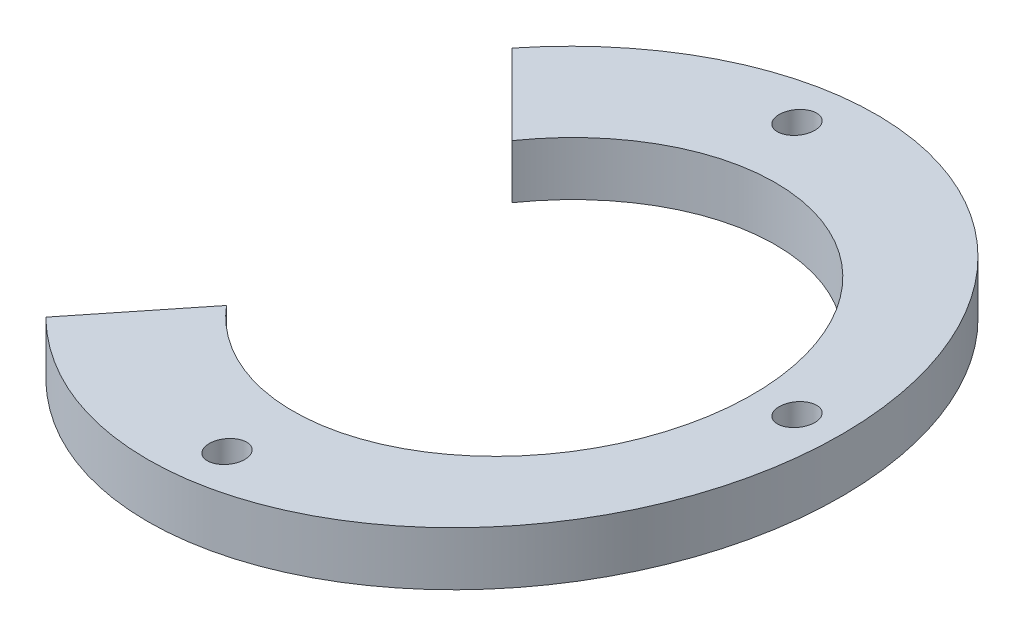
ISO-10303-21;
HEADER;
FILE_DESCRIPTION(('STEP AP214'),'2;1');
FILE_NAME('part.step','',(''),(''),'','','');
FILE_SCHEMA(('AUTOMOTIVE_DESIGN { 1 0 10303 214 1 1 1 1 }'));
ENDSEC;
DATA;
#1=APPLICATION_CONTEXT('core data for automotive mechanical design processes');
#2=APPLICATION_PROTOCOL_DEFINITION('international standard','automotive_design',2000,#1);
#3=PRODUCT_CONTEXT('',#1,'mechanical');
#4=PRODUCT('Part','Part','',(#3));
#5=PRODUCT_RELATED_PRODUCT_CATEGORY('part','',(#4));
#6=PRODUCT_DEFINITION_FORMATION('','',#4);
#7=PRODUCT_DEFINITION_CONTEXT('part definition',#1,'design');
#8=PRODUCT_DEFINITION('design','',#6,#7);
#9=PRODUCT_DEFINITION_SHAPE('','',#8);
#10=(LENGTH_UNIT() NAMED_UNIT(*) SI_UNIT(.MILLI.,.METRE.));
#11=(NAMED_UNIT(*) PLANE_ANGLE_UNIT() SI_UNIT($,.RADIAN.));
#12=(NAMED_UNIT(*) SI_UNIT($,.STERADIAN.) SOLID_ANGLE_UNIT());
#13=UNCERTAINTY_MEASURE_WITH_UNIT(LENGTH_MEASURE(1.E-05),#10,'distance_accuracy_value','');
#14=(GEOMETRIC_REPRESENTATION_CONTEXT(3) GLOBAL_UNCERTAINTY_ASSIGNED_CONTEXT((#13)) GLOBAL_UNIT_ASSIGNED_CONTEXT((#10,
#11,#12)) REPRESENTATION_CONTEXT('',''));
#15=CARTESIAN_POINT('',(0.,0.,0.));
#16=DIRECTION('',(0.,0.,1.));
#17=DIRECTION('',(1.,0.,0.));
#18=AXIS2_PLACEMENT_3D('',#15,#16,#17);
#19=CARTESIAN_POINT('',(1.04083408558608E-13,50.,-32.));
#20=DIRECTION('',(0.,-1.,0.));
#21=DIRECTION('',(0.,0.,-1.));
#22=AXIS2_PLACEMENT_3D('',#19,#20,#21);
#23=CYLINDRICAL_SURFACE('',#22,2.);
#24=CARTESIAN_POINT('',(1.04083408558608E-13,6.16275729327941,-32.));
#25=DIRECTION('',(-0.111468932206326,0.993767919160596,0.));
#26=DIRECTION('',(-0.993767919160596,-0.111468932206326,0.));
#27=AXIS2_PLACEMENT_3D('',#24,#25,#26);
#28=ELLIPSE('',#27,2.01254232647129,2.);
#29=CARTESIAN_POINT('',(-1.9999999999999,5.93842134912762,-32.));
#30=VERTEX_POINT('',#29);
#31=EDGE_CURVE('E121',#30,#30,#28,.F.);
#32=ORIENTED_EDGE('',*,*,#31,.T.);
#33=EDGE_LOOP('',(#32));
#34=FACE_BOUND('',#33,.T.);
#35=CARTESIAN_POINT('',(1.04083408558608E-13,10.187841946222,-32.));
#36=DIRECTION('',(0.111468932206326,-0.993767919160596,0.));
#37=DIRECTION('',(-0.993767919160596,-0.111468932206326,0.));
#38=AXIS2_PLACEMENT_3D('',#35,#36,#37);
#39=ELLIPSE('',#38,2.01254232647129,2.);
#40=CARTESIAN_POINT('',(-1.9999999999999,9.9635060020702,-32.));
#41=VERTEX_POINT('',#40);
#42=EDGE_CURVE('E116',#41,#41,#39,.F.);
#43=ORIENTED_EDGE('',*,*,#42,.T.);
#44=EDGE_LOOP('',(#43));
#45=FACE_BOUND('',#44,.T.);
#46=ADVANCED_FACE('F59',(#34,#45),#23,.F.);
#47=CARTESIAN_POINT('',(-1.12855053858504,10.0612547209237,-500.));
#48=DIRECTION('',(0.111468932206326,-0.993767919160596,0.));
#49=DIRECTION('',(0.993767919160596,0.111468932206326,0.));
#50=AXIS2_PLACEMENT_3D('',#47,#48,#49);
#51=PLANE('',#50);
#52=CARTESIAN_POINT('',(2.5,10.4682618764117,0.));
#53=DIRECTION('',(0.111468932206326,-0.993767919160596,0.));
#54=DIRECTION('',(-0.993767919160596,-0.111468932206326,0.));
#55=AXIS2_PLACEMENT_3D('',#52,#53,#54);
#56=ELLIPSE('',#55,24.6536434992733,24.5);
#57=CARTESIAN_POINT('',(-16.0289611956275,8.38990587442523,-16.0289611956274));
#58=VERTEX_POINT('',#57);
#59=CARTESIAN_POINT('',(-16.0289611956275,8.38990587442523,16.0289611956274));
#60=VERTEX_POINT('',#59);
#61=EDGE_CURVE('E130',#58,#60,#56,.T.);
#62=ORIENTED_EDGE('',*,*,#61,.T.);
#63=DIRECTION('',(-0.704893077042286,-0.0790664269821706,0.704893077042278));
#64=VECTOR('',#63,1.);
#65=CARTESIAN_POINT('',(247.869322195,37.9908411566617,-247.869322194997));
#66=LINE('',#65,#64);
#67=CARTESIAN_POINT('',(-26.1629509039024,7.25319679981005,26.1629509039021));
#68=VERTEX_POINT('',#67);
#69=EDGE_CURVE('E214',#60,#68,#66,.T.);
#70=ORIENTED_EDGE('',*,*,#69,.T.);
#71=CARTESIAN_POINT('',(0.,10.187841946222,0.));
#72=DIRECTION('',(0.111468932206326,-0.993767919160596,0.));
#73=DIRECTION('',(-0.993767919160596,-0.111468932206326,0.));
#74=AXIS2_PLACEMENT_3D('',#71,#72,#73);
#75=ELLIPSE('',#74,37.2320330397189,37.);
#76=CARTESIAN_POINT('',(-26.1629509039024,7.25319679981005,-26.1629509039021));
#77=VERTEX_POINT('',#76);
#78=EDGE_CURVE('E104',#77,#68,#75,.T.);
#79=ORIENTED_EDGE('',*,*,#78,.F.);
#80=DIRECTION('',(-0.704893077042286,-0.0790664269821706,-0.704893077042278));
#81=VECTOR('',#80,1.);
#82=CARTESIAN_POINT('',(-249.004927867137,-17.7425358495392,-249.004927867134));
#83=LINE('',#82,#81);
#84=EDGE_CURVE('E81',#58,#77,#83,.T.);
#85=ORIENTED_EDGE('',*,*,#84,.F.);
#86=EDGE_LOOP('',(#62,#70,#79,#85));
#87=FACE_BOUND('',#86,.T.);
#88=CARTESIAN_POINT('',(0.,10.187841946222,32.));
#89=DIRECTION('',(0.111468932206326,-0.993767919160596,0.));
#90=DIRECTION('',(-0.993767919160596,-0.111468932206326,0.));
#91=AXIS2_PLACEMENT_3D('',#88,#89,#90);
#92=ELLIPSE('',#91,2.01254232647129,2.);
#93=CARTESIAN_POINT('',(-2.,9.9635060020702,32.));
#94=VERTEX_POINT('',#93);
#95=EDGE_CURVE('E127',#94,#94,#92,.T.);
#96=ORIENTED_EDGE('',*,*,#95,.T.);
#97=EDGE_LOOP('',(#96));
#98=FACE_BOUND('',#97,.T.);
#99=ORIENTED_EDGE('',*,*,#42,.F.);
#100=EDGE_LOOP('',(#99));
#101=FACE_BOUND('',#100,.T.);
#102=CARTESIAN_POINT('',(32.,13.7772170526506,1.04083408558608E-13));
#103=DIRECTION('',(0.111468932206326,-0.993767919160596,0.));
#104=DIRECTION('',(-0.993767919160596,-0.111468932206326,0.));
#105=AXIS2_PLACEMENT_3D('',#102,#103,#104);
#106=ELLIPSE('',#105,2.01254232647129,2.);
#107=CARTESIAN_POINT('',(30.,13.5528811084988,1.04083408558608E-13));
#108=VERTEX_POINT('',#107);
#109=EDGE_CURVE('E119',#108,#108,#106,.F.);
#110=ORIENTED_EDGE('',*,*,#109,.F.);
#111=EDGE_LOOP('',(#110));
#112=FACE_BOUND('',#111,.T.);
#113=ADVANCED_FACE('F173',(#87,#98,#101,#112),#51,.F.);
#114=CARTESIAN_POINT('',(-0.459736945347083,4.09864720596016,-500.));
#115=DIRECTION('',(0.111468932206326,-0.993767919160596,0.));
#116=DIRECTION('',(0.993767919160596,0.111468932206326,0.));
#117=AXIS2_PLACEMENT_3D('',#114,#115,#116);
#118=PLANE('',#117);
#119=DIRECTION('',(-0.704893077042286,-0.0790664269821707,0.704893077042278));
#120=VECTOR('',#119,1.);
#121=CARTESIAN_POINT('',(248.205819535666,31.9909584015593,-248.205819535664));
#122=LINE('',#121,#120);
#123=CARTESIAN_POINT('',(-16.0289611956275,2.35227889501136,16.0289611956274));
#124=VERTEX_POINT('',#123);
#125=CARTESIAN_POINT('',(-26.1629509039024,1.21556982039618,26.1629509039021));
#126=VERTEX_POINT('',#125);
#127=EDGE_CURVE('E74',#124,#126,#122,.T.);
#128=ORIENTED_EDGE('',*,*,#127,.F.);
#129=CARTESIAN_POINT('',(2.5,4.43063489699785,0.));
#130=DIRECTION('',(0.111468932206326,-0.993767919160596,0.));
#131=DIRECTION('',(-0.993767919160596,-0.111468932206326,0.));
#132=AXIS2_PLACEMENT_3D('',#129,#130,#131);
#133=ELLIPSE('',#132,24.6536434992733,24.5);
#134=CARTESIAN_POINT('',(-16.0289611956275,2.35227889501136,-16.0289611956274));
#135=VERTEX_POINT('',#134);
#136=EDGE_CURVE('E112',#135,#124,#133,.T.);
#137=ORIENTED_EDGE('',*,*,#136,.F.);
#138=DIRECTION('',(-0.704893077042286,-0.0790664269821707,-0.704893077042278));
#139=VECTOR('',#138,1.);
#140=CARTESIAN_POINT('',(-248.66843052647,-23.7424186046416,-248.668430526468));
#141=LINE('',#140,#139);
#142=CARTESIAN_POINT('',(-26.1629509039024,1.21556982039618,-26.1629509039021));
#143=VERTEX_POINT('',#142);
#144=EDGE_CURVE('E98',#135,#143,#141,.T.);
#145=ORIENTED_EDGE('',*,*,#144,.T.);
#146=CARTESIAN_POINT('',(0.,4.15021496680811,0.));
#147=DIRECTION('',(0.111468932206326,-0.993767919160596,0.));
#148=DIRECTION('',(-0.993767919160596,-0.111468932206326,0.));
#149=AXIS2_PLACEMENT_3D('',#146,#147,#148);
#150=ELLIPSE('',#149,37.2320330397189,37.);
#151=EDGE_CURVE('E110',#143,#126,#150,.T.);
#152=ORIENTED_EDGE('',*,*,#151,.T.);
#153=EDGE_LOOP('',(#128,#137,#145,#152));
#154=FACE_BOUND('',#153,.T.);
#155=CARTESIAN_POINT('',(1.04083408558608E-13,4.15021496680812,-32.));
#156=DIRECTION('',(0.111468932206326,-0.993767919160596,0.));
#157=DIRECTION('',(-0.993767919160596,-0.111468932206326,0.));
#158=AXIS2_PLACEMENT_3D('',#155,#156,#157);
#159=ELLIPSE('',#158,3.52194907132476,3.5);
#160=CARTESIAN_POINT('',(-3.4999999999999,3.75762706454249,-32.));
#161=VERTEX_POINT('',#160);
#162=EDGE_CURVE('E147',#161,#161,#159,.F.);
#163=ORIENTED_EDGE('',*,*,#162,.T.);
#164=EDGE_LOOP('',(#163));
#165=FACE_BOUND('',#164,.T.);
#166=CARTESIAN_POINT('',(32.,7.73959007323674,1.04083408558608E-13));
#167=DIRECTION('',(0.111468932206326,-0.993767919160596,0.));
#168=DIRECTION('',(-0.993767919160596,-0.111468932206326,0.));
#169=AXIS2_PLACEMENT_3D('',#166,#167,#168);
#170=ELLIPSE('',#169,3.52194907132476,3.5);
#171=CARTESIAN_POINT('',(28.5,7.34700217097111,1.04083408558608E-13));
#172=VERTEX_POINT('',#171);
#173=EDGE_CURVE('E144',#172,#172,#170,.F.);
#174=ORIENTED_EDGE('',*,*,#173,.T.);
#175=EDGE_LOOP('',(#174));
#176=FACE_BOUND('',#175,.T.);
#177=CARTESIAN_POINT('',(0.,4.15021496680811,32.));
#178=DIRECTION('',(0.111468932206326,-0.993767919160596,0.));
#179=DIRECTION('',(-0.993767919160596,-0.111468932206326,0.));
#180=AXIS2_PLACEMENT_3D('',#177,#178,#179);
#181=ELLIPSE('',#180,3.52194907132476,3.5);
#182=CARTESIAN_POINT('',(-3.5,3.75762706454248,32.));
#183=VERTEX_POINT('',#182);
#184=EDGE_CURVE('E141',#183,#183,#181,.F.);
#185=ORIENTED_EDGE('',*,*,#184,.T.);
#186=EDGE_LOOP('',(#185));
#187=FACE_BOUND('',#186,.T.);
#188=ADVANCED_FACE('F108',(#154,#165,#176,#187),#118,.T.);
#189=CARTESIAN_POINT('',(32.,50.,1.04083408558608E-13));
#190=DIRECTION('',(0.,-1.,0.));
#191=DIRECTION('',(0.,0.,-1.));
#192=AXIS2_PLACEMENT_3D('',#189,#190,#191);
#193=CYLINDRICAL_SURFACE('',#192,2.);
#194=CARTESIAN_POINT('',(32.,9.75213239970803,1.04083408558608E-13));
#195=DIRECTION('',(-0.111468932206326,0.993767919160596,0.));
#196=DIRECTION('',(-0.993767919160596,-0.111468932206326,0.));
#197=AXIS2_PLACEMENT_3D('',#194,#195,#196);
#198=ELLIPSE('',#197,2.01254232647129,2.);
#199=CARTESIAN_POINT('',(30.,9.52779645555624,1.04083408558608E-13));
#200=VERTEX_POINT('',#199);
#201=EDGE_CURVE('E137',#200,#200,#198,.F.);
#202=ORIENTED_EDGE('',*,*,#201,.T.);
#203=EDGE_LOOP('',(#202));
#204=FACE_BOUND('',#203,.T.);
#205=ORIENTED_EDGE('',*,*,#109,.T.);
#206=EDGE_LOOP('',(#205));
#207=FACE_BOUND('',#206,.T.);
#208=ADVANCED_FACE('F61',(#204,#207),#193,.F.);
#209=CARTESIAN_POINT('',(0.,50.,32.));
#210=DIRECTION('',(0.,-1.,0.));
#211=DIRECTION('',(0.,0.,-1.));
#212=AXIS2_PLACEMENT_3D('',#209,#210,#211);
#213=CYLINDRICAL_SURFACE('',#212,2.);
#214=CARTESIAN_POINT('',(0.,6.1627572932794,32.));
#215=DIRECTION('',(-0.111468932206326,0.993767919160596,0.));
#216=DIRECTION('',(-0.993767919160596,-0.111468932206326,0.));
#217=AXIS2_PLACEMENT_3D('',#214,#215,#216);
#218=ELLIPSE('',#217,2.01254232647129,2.);
#219=CARTESIAN_POINT('',(-2.,5.93842134912761,32.));
#220=VERTEX_POINT('',#219);
#221=EDGE_CURVE('E134',#220,#220,#218,.T.);
#222=ORIENTED_EDGE('',*,*,#221,.F.);
#223=EDGE_LOOP('',(#222));
#224=FACE_BOUND('',#223,.T.);
#225=ORIENTED_EDGE('',*,*,#95,.F.);
#226=EDGE_LOOP('',(#225));
#227=FACE_BOUND('',#226,.T.);
#228=ADVANCED_FACE('F187',(#224,#227),#213,.F.);
#229=CARTESIAN_POINT('',(2.5,50.,0.));
#230=DIRECTION('',(0.,-1.,0.));
#231=DIRECTION('',(0.,0.,-1.));
#232=AXIS2_PLACEMENT_3D('',#229,#230,#231);
#233=CYLINDRICAL_SURFACE('',#232,24.5);
#234=DIRECTION('',(0.,-1.,0.));
#235=VECTOR('',#234,1.);
#236=CARTESIAN_POINT('',(-16.0289611956275,50.,16.0289611956274));
#237=LINE('',#236,#235);
#238=EDGE_CURVE('E223',#60,#124,#237,.T.);
#239=ORIENTED_EDGE('',*,*,#238,.F.);
#240=ORIENTED_EDGE('',*,*,#61,.F.);
#241=DIRECTION('',(0.,-1.,0.));
#242=VECTOR('',#241,1.);
#243=CARTESIAN_POINT('',(-16.0289611956275,50.,-16.0289611956274));
#244=LINE('',#243,#242);
#245=EDGE_CURVE('E113',#58,#135,#244,.T.);
#246=ORIENTED_EDGE('',*,*,#245,.T.);
#247=ORIENTED_EDGE('',*,*,#136,.T.);
#248=EDGE_LOOP('',(#239,#240,#246,#247));
#249=FACE_BOUND('',#248,.T.);
#250=ADVANCED_FACE('F185',(#249),#233,.F.);
#251=CARTESIAN_POINT('',(0.,50.,0.));
#252=DIRECTION('',(0.,-1.,0.));
#253=DIRECTION('',(0.,0.,-1.));
#254=AXIS2_PLACEMENT_3D('',#251,#252,#253);
#255=CYLINDRICAL_SURFACE('',#254,37.);
#256=ORIENTED_EDGE('',*,*,#78,.T.);
#257=DIRECTION('',(0.,-1.,0.));
#258=VECTOR('',#257,1.);
#259=CARTESIAN_POINT('',(-26.1629509039024,50.,26.1629509039021));
#260=LINE('',#259,#258);
#261=EDGE_CURVE('E12',#68,#126,#260,.T.);
#262=ORIENTED_EDGE('',*,*,#261,.T.);
#263=ORIENTED_EDGE('',*,*,#151,.F.);
#264=DIRECTION('',(0.,-1.,0.));
#265=VECTOR('',#264,1.);
#266=CARTESIAN_POINT('',(-26.1629509039024,50.,-26.1629509039021));
#267=LINE('',#266,#265);
#268=EDGE_CURVE('E67',#77,#143,#267,.T.);
#269=ORIENTED_EDGE('',*,*,#268,.F.);
#270=EDGE_LOOP('',(#256,#262,#263,#269));
#271=FACE_BOUND('',#270,.T.);
#272=ADVANCED_FACE('F115',(#271),#255,.T.);
#273=CARTESIAN_POINT('',(0.,19.6826680106687,32.));
#274=DIRECTION('',(0.,-1.,0.));
#275=DIRECTION('',(0.,0.,-1.));
#276=AXIS2_PLACEMENT_3D('',#273,#274,#275);
#277=CYLINDRICAL_SURFACE('',#276,3.5);
#278=ORIENTED_EDGE('',*,*,#184,.F.);
#279=EDGE_LOOP('',(#278));
#280=FACE_BOUND('',#279,.T.);
#281=CARTESIAN_POINT('',(0.,6.1627572932794,32.));
#282=DIRECTION('',(-0.111468932206326,0.993767919160596,0.));
#283=DIRECTION('',(-0.993767919160596,-0.111468932206326,0.));
#284=AXIS2_PLACEMENT_3D('',#281,#282,#283);
#285=ELLIPSE('',#284,3.52194907132476,3.5);
#286=CARTESIAN_POINT('',(-3.5,5.77016939101377,32.));
#287=VERTEX_POINT('',#286);
#288=EDGE_CURVE('E211',#287,#287,#285,.T.);
#289=ORIENTED_EDGE('',*,*,#288,.T.);
#290=EDGE_LOOP('',(#289));
#291=FACE_BOUND('',#290,.T.);
#292=ADVANCED_FACE('F184',(#280,#291),#277,.F.);
#293=CARTESIAN_POINT('',(-0.682674809759735,6.08618304428135,0.));
#294=DIRECTION('',(-0.111468932206326,0.993767919160596,0.));
#295=DIRECTION('',(-0.993767919160596,-0.111468932206326,0.));
#296=AXIS2_PLACEMENT_3D('',#293,#294,#295);
#297=PLANE('',#296);
#298=ORIENTED_EDGE('',*,*,#221,.T.);
#299=EDGE_LOOP('',(#298));
#300=FACE_BOUND('',#299,.T.);
#301=ORIENTED_EDGE('',*,*,#288,.F.);
#302=EDGE_LOOP('',(#301));
#303=FACE_BOUND('',#302,.T.);
#304=ADVANCED_FACE('F205',(#300,#303),#297,.F.);
#305=CARTESIAN_POINT('',(-0.682674809759735,6.08618304428135,0.));
#306=DIRECTION('',(-0.111468932206326,0.993767919160596,0.));
#307=DIRECTION('',(-0.993767919160596,-0.111468932206326,0.));
#308=AXIS2_PLACEMENT_3D('',#305,#306,#307);
#309=PLANE('',#308);
#310=CARTESIAN_POINT('',(32.,9.75213239970803,1.04083408558608E-13));
#311=DIRECTION('',(-0.111468932206326,0.993767919160596,0.));
#312=DIRECTION('',(-0.993767919160596,-0.111468932206326,0.));
#313=AXIS2_PLACEMENT_3D('',#310,#311,#312);
#314=ELLIPSE('',#313,3.52194907132476,3.5);
#315=CARTESIAN_POINT('',(28.5,9.3595444974424,1.04083408558608E-13));
#316=VERTEX_POINT('',#315);
#317=EDGE_CURVE('E213',#316,#316,#314,.T.);
#318=ORIENTED_EDGE('',*,*,#317,.F.);
#319=EDGE_LOOP('',(#318));
#320=FACE_BOUND('',#319,.T.);
#321=ORIENTED_EDGE('',*,*,#201,.F.);
#322=EDGE_LOOP('',(#321));
#323=FACE_BOUND('',#322,.T.);
#324=ADVANCED_FACE('F167',(#320,#323),#309,.F.);
#325=CARTESIAN_POINT('',(32.,19.6826680106687,1.04083408558608E-13));
#326=DIRECTION('',(0.,-1.,0.));
#327=DIRECTION('',(0.,0.,-1.));
#328=AXIS2_PLACEMENT_3D('',#325,#326,#327);
#329=CYLINDRICAL_SURFACE('',#328,3.5);
#330=ORIENTED_EDGE('',*,*,#173,.F.);
#331=EDGE_LOOP('',(#330));
#332=FACE_BOUND('',#331,.T.);
#333=ORIENTED_EDGE('',*,*,#317,.T.);
#334=EDGE_LOOP('',(#333));
#335=FACE_BOUND('',#334,.T.);
#336=ADVANCED_FACE('F158',(#332,#335),#329,.F.);
#337=CARTESIAN_POINT('',(-0.682674809759735,6.08618304428135,0.));
#338=DIRECTION('',(-0.111468932206326,0.993767919160596,0.));
#339=DIRECTION('',(-0.993767919160596,-0.111468932206326,0.));
#340=AXIS2_PLACEMENT_3D('',#337,#338,#339);
#341=PLANE('',#340);
#342=CARTESIAN_POINT('',(1.04083408558608E-13,6.16275729327941,-32.));
#343=DIRECTION('',(-0.111468932206326,0.993767919160596,0.));
#344=DIRECTION('',(-0.993767919160596,-0.111468932206326,0.));
#345=AXIS2_PLACEMENT_3D('',#342,#343,#344);
#346=ELLIPSE('',#345,3.52194907132476,3.5);
#347=CARTESIAN_POINT('',(-3.4999999999999,5.77016939101378,-32.));
#348=VERTEX_POINT('',#347);
#349=EDGE_CURVE('E138',#348,#348,#346,.T.);
#350=ORIENTED_EDGE('',*,*,#349,.F.);
#351=EDGE_LOOP('',(#350));
#352=FACE_BOUND('',#351,.T.);
#353=ORIENTED_EDGE('',*,*,#31,.F.);
#354=EDGE_LOOP('',(#353));
#355=FACE_BOUND('',#354,.T.);
#356=ADVANCED_FACE('F155',(#352,#355),#341,.F.);
#357=CARTESIAN_POINT('',(1.04083408558608E-13,19.6826680106687,-32.));
#358=DIRECTION('',(0.,-1.,0.));
#359=DIRECTION('',(0.,0.,-1.));
#360=AXIS2_PLACEMENT_3D('',#357,#358,#359);
#361=CYLINDRICAL_SURFACE('',#360,3.5);
#362=ORIENTED_EDGE('',*,*,#162,.F.);
#363=EDGE_LOOP('',(#362));
#364=FACE_BOUND('',#363,.T.);
#365=ORIENTED_EDGE('',*,*,#349,.T.);
#366=EDGE_LOOP('',(#365));
#367=FACE_BOUND('',#366,.T.);
#368=ADVANCED_FACE('F157',(#364,#367),#361,.F.);
#369=CARTESIAN_POINT('',(0.,10.,0.));
#370=DIRECTION('',(-0.707106781186544,0.,0.707106781186551));
#371=DIRECTION('',(0.707106781186551,0.,0.707106781186544));
#372=AXIS2_PLACEMENT_3D('',#369,#370,#371);
#373=PLANE('',#372);
#374=ORIENTED_EDGE('',*,*,#84,.T.);
#375=ORIENTED_EDGE('',*,*,#268,.T.);
#376=ORIENTED_EDGE('',*,*,#144,.F.);
#377=ORIENTED_EDGE('',*,*,#245,.F.);
#378=EDGE_LOOP('',(#374,#375,#376,#377));
#379=FACE_BOUND('',#378,.T.);
#380=ADVANCED_FACE('F97',(#379),#373,.T.);
#381=CARTESIAN_POINT('',(0.,10.,0.));
#382=DIRECTION('',(0.707106781186544,0.,0.707106781186551));
#383=DIRECTION('',(0.707106781186551,0.,-0.707106781186544));
#384=AXIS2_PLACEMENT_3D('',#381,#382,#383);
#385=PLANE('',#384);
#386=ORIENTED_EDGE('',*,*,#238,.T.);
#387=ORIENTED_EDGE('',*,*,#127,.T.);
#388=ORIENTED_EDGE('',*,*,#261,.F.);
#389=ORIENTED_EDGE('',*,*,#69,.F.);
#390=EDGE_LOOP('',(#386,#387,#388,#389));
#391=FACE_BOUND('',#390,.T.);
#392=ADVANCED_FACE('F228',(#391),#385,.F.);
#393=CLOSED_SHELL('',(#46,#113,#188,#208,#228,#250,#272,#292,#304,#324,#336,#356,#368,#380,#392));
#394=MANIFOLD_SOLID_BREP('B2',#393);
#395=ADVANCED_BREP_SHAPE_REPRESENTATION('',(#18,#394),#14);
#396=SHAPE_DEFINITION_REPRESENTATION(#9,#395);
ENDSEC;
END-ISO-10303-21;
